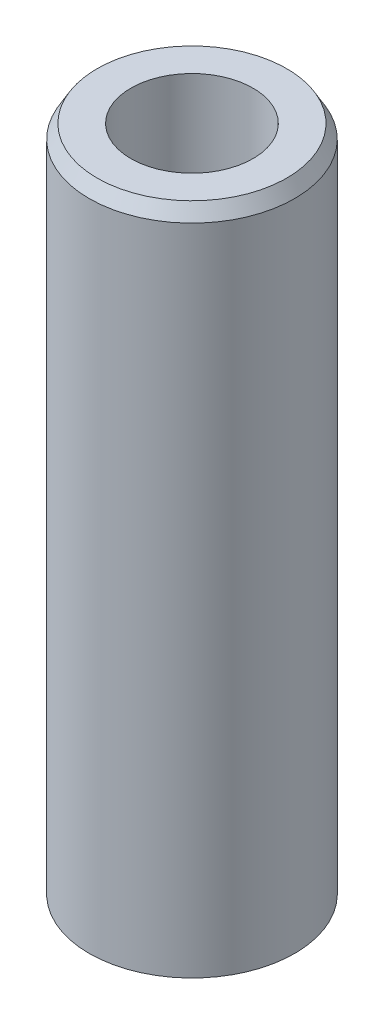
ISO-10303-21;
HEADER;
FILE_DESCRIPTION(('STEP AP214'),'2;1');
FILE_NAME('part.step','',(''),(''),'','','');
FILE_SCHEMA(('AUTOMOTIVE_DESIGN { 1 0 10303 214 1 1 1 1 }'));
ENDSEC;
DATA;
#1=APPLICATION_CONTEXT('core data for automotive mechanical design processes');
#2=APPLICATION_PROTOCOL_DEFINITION('international standard','automotive_design',2000,#1);
#3=PRODUCT_CONTEXT('',#1,'mechanical');
#4=PRODUCT('Part','Part','',(#3));
#5=PRODUCT_RELATED_PRODUCT_CATEGORY('part','',(#4));
#6=PRODUCT_DEFINITION_FORMATION('','',#4);
#7=PRODUCT_DEFINITION_CONTEXT('part definition',#1,'design');
#8=PRODUCT_DEFINITION('design','',#6,#7);
#9=PRODUCT_DEFINITION_SHAPE('','',#8);
#10=(LENGTH_UNIT() NAMED_UNIT(*) SI_UNIT(.MILLI.,.METRE.));
#11=(NAMED_UNIT(*) PLANE_ANGLE_UNIT() SI_UNIT($,.RADIAN.));
#12=(NAMED_UNIT(*) SI_UNIT($,.STERADIAN.) SOLID_ANGLE_UNIT());
#13=UNCERTAINTY_MEASURE_WITH_UNIT(LENGTH_MEASURE(1.E-05),#10,'distance_accuracy_value','');
#14=(GEOMETRIC_REPRESENTATION_CONTEXT(3) GLOBAL_UNCERTAINTY_ASSIGNED_CONTEXT((#13)) GLOBAL_UNIT_ASSIGNED_CONTEXT((#10,
#11,#12)) REPRESENTATION_CONTEXT('',''));
#15=CARTESIAN_POINT('',(0.,0.,0.));
#16=DIRECTION('',(0.,0.,1.));
#17=DIRECTION('',(1.,0.,0.));
#18=AXIS2_PLACEMENT_3D('',#15,#16,#17);
#19=CARTESIAN_POINT('',(0.,115.021167094316,0.));
#20=DIRECTION('',(0.,-1.,0.));
#21=DIRECTION('',(0.,0.,-1.));
#22=AXIS2_PLACEMENT_3D('',#19,#20,#21);
#23=CYLINDRICAL_SURFACE('',#22,17.5);
#24=CARTESIAN_POINT('',(0.,112.679900352407,0.));
#25=DIRECTION('',(0.,1.,0.));
#26=DIRECTION('',(0.,0.,1.));
#27=AXIS2_PLACEMENT_3D('',#24,#25,#26);
#28=CIRCLE('',#27,17.5);
#29=CARTESIAN_POINT('',(0.,112.679900352407,17.5));
#30=VERTEX_POINT('',#29);
#31=EDGE_CURVE('E50',#30,#30,#28,.F.);
#32=ORIENTED_EDGE('',*,*,#31,.T.);
#33=EDGE_LOOP('',(#32));
#34=FACE_BOUND('',#33,.T.);
#35=CARTESIAN_POINT('',(0.,1.35173098368588,0.));
#36=DIRECTION('',(0.,1.,0.));
#37=DIRECTION('',(0.,0.,1.));
#38=AXIS2_PLACEMENT_3D('',#35,#36,#37);
#39=CIRCLE('',#38,17.5);
#40=CARTESIAN_POINT('',(0.,1.35173098368588,17.5));
#41=VERTEX_POINT('',#40);
#42=EDGE_CURVE('E51',#41,#41,#39,.T.);
#43=ORIENTED_EDGE('',*,*,#42,.T.);
#44=EDGE_LOOP('',(#43));
#45=FACE_BOUND('',#44,.T.);
#46=ADVANCED_FACE('F39',(#34,#45),#23,.T.);
#47=CARTESIAN_POINT('',(0.,115.021167094316,0.));
#48=DIRECTION('',(0.,1.,0.));
#49=DIRECTION('',(0.,0.,1.));
#50=AXIS2_PLACEMENT_3D('',#47,#48,#49);
#51=PLANE('',#50);
#52=CARTESIAN_POINT('',(0.,115.021167094316,0.));
#53=DIRECTION('',(0.,1.,0.));
#54=DIRECTION('',(0.,0.,1.));
#55=AXIS2_PLACEMENT_3D('',#52,#53,#54);
#56=CIRCLE('',#55,16.1482690163141);
#57=CARTESIAN_POINT('',(0.,115.021167094316,16.1482690163141));
#58=VERTEX_POINT('',#57);
#59=EDGE_CURVE('E54',#58,#58,#56,.T.);
#60=ORIENTED_EDGE('',*,*,#59,.T.);
#61=EDGE_LOOP('',(#60));
#62=FACE_BOUND('',#61,.T.);
#63=CARTESIAN_POINT('',(0.,115.021167094316,0.));
#64=DIRECTION('',(0.,1.,0.));
#65=DIRECTION('',(0.,0.,1.));
#66=AXIS2_PLACEMENT_3D('',#63,#64,#65);
#67=CIRCLE('',#66,10.4032611377122);
#68=CARTESIAN_POINT('',(0.,115.021167094316,10.4032611377122));
#69=VERTEX_POINT('',#68);
#70=EDGE_CURVE('E58',#69,#69,#67,.T.);
#71=ORIENTED_EDGE('',*,*,#70,.F.);
#72=EDGE_LOOP('',(#71));
#73=FACE_BOUND('',#72,.T.);
#74=ADVANCED_FACE('F69',(#62,#73),#51,.T.);
#75=CARTESIAN_POINT('',(0.,0.,0.));
#76=DIRECTION('',(0.,1.,0.));
#77=DIRECTION('',(0.,0.,1.));
#78=AXIS2_PLACEMENT_3D('',#75,#76,#77);
#79=PLANE('',#78);
#80=CARTESIAN_POINT('',(0.,0.,0.));
#81=DIRECTION('',(0.,1.,0.));
#82=DIRECTION('',(0.,0.,1.));
#83=AXIS2_PLACEMENT_3D('',#80,#81,#82);
#84=CIRCLE('',#83,15.158733258091);
#85=CARTESIAN_POINT('',(0.,0.,15.158733258091));
#86=VERTEX_POINT('',#85);
#87=EDGE_CURVE('E10',#86,#86,#84,.F.);
#88=ORIENTED_EDGE('',*,*,#87,.T.);
#89=EDGE_LOOP('',(#88));
#90=FACE_BOUND('',#89,.T.);
#91=CARTESIAN_POINT('',(0.,0.,0.));
#92=DIRECTION('',(0.,1.,0.));
#93=DIRECTION('',(0.,0.,1.));
#94=AXIS2_PLACEMENT_3D('',#91,#92,#93);
#95=CIRCLE('',#94,10.4032611377122);
#96=CARTESIAN_POINT('',(0.,0.,10.4032611377122));
#97=VERTEX_POINT('',#96);
#98=EDGE_CURVE('E63',#97,#97,#95,.T.);
#99=ORIENTED_EDGE('',*,*,#98,.T.);
#100=EDGE_LOOP('',(#99));
#101=FACE_BOUND('',#100,.T.);
#102=ADVANCED_FACE('F75',(#90,#101),#79,.F.);
#103=CARTESIAN_POINT('',(0.,115.021167094316,0.));
#104=DIRECTION('',(0.,-1.,0.));
#105=DIRECTION('',(0.,0.,-1.));
#106=AXIS2_PLACEMENT_3D('',#103,#104,#105);
#107=CYLINDRICAL_SURFACE('',#106,10.4032611377122);
#108=ORIENTED_EDGE('',*,*,#70,.T.);
#109=EDGE_LOOP('',(#108));
#110=FACE_BOUND('',#109,.T.);
#111=ORIENTED_EDGE('',*,*,#98,.F.);
#112=EDGE_LOOP('',(#111));
#113=FACE_BOUND('',#112,.T.);
#114=ADVANCED_FACE('F70',(#110,#113),#107,.F.);
#115=CARTESIAN_POINT('',(0.,115.021167094316,0.));
#116=DIRECTION('',(0.,-1.,0.));
#117=DIRECTION('',(0.,0.,-1.));
#118=AXIS2_PLACEMENT_3D('',#115,#116,#117);
#119=CONICAL_SURFACE('',#118,16.1482690163141,0.523598775598295);
#120=ORIENTED_EDGE('',*,*,#31,.F.);
#121=EDGE_LOOP('',(#120));
#122=FACE_BOUND('',#121,.T.);
#123=ORIENTED_EDGE('',*,*,#59,.F.);
#124=EDGE_LOOP('',(#123));
#125=FACE_BOUND('',#124,.T.);
#126=ADVANCED_FACE('F81',(#122,#125),#119,.T.);
#127=CARTESIAN_POINT('',(0.,1.35173098368588,0.));
#128=DIRECTION('',(0.,1.,0.));
#129=DIRECTION('',(0.,0.,1.));
#130=AXIS2_PLACEMENT_3D('',#127,#128,#129);
#131=CONICAL_SURFACE('',#130,17.5,1.0471975511966);
#132=CARTESIAN_POINT('',(0.,0.,15.158733258091));
#133=CARTESIAN_POINT('',(0.,0.014080531080061,15.1831214533192));
#134=CARTESIAN_POINT('',(0.,0.0281610621601222,15.2075096485475));
#135=CARTESIAN_POINT('',(0.,0.0563221243202447,15.2562860390039));
#136=CARTESIAN_POINT('',(0.,0.0704026554003059,15.2806742342321));
#137=CARTESIAN_POINT('',(0.,0.0985637175604284,15.3294506246885));
#138=CARTESIAN_POINT('',(0.,0.11264424864049,15.3538388199168));
#139=CARTESIAN_POINT('',(0.,0.140805310800612,15.4026152103732));
#140=CARTESIAN_POINT('',(0.,0.154885841880673,15.4270034056014));
#141=CARTESIAN_POINT('',(0.,0.183046904040796,15.4757797960579));
#142=CARTESIAN_POINT('',(0.,0.197127435120857,15.5001679912861));
#143=CARTESIAN_POINT('',(0.,0.22528849728098,15.5489443817425));
#144=CARTESIAN_POINT('',(0.,0.239369028361041,15.5733325769707));
#145=CARTESIAN_POINT('',(0.,0.267530090521163,15.6221089674272));
#146=CARTESIAN_POINT('',(0.,0.281610621601224,15.6464971626554));
#147=CARTESIAN_POINT('',(0.,0.309771683761347,15.6952735531118));
#148=CARTESIAN_POINT('',(0.,0.323852214841408,15.71966174834));
#149=CARTESIAN_POINT('',(0.,0.352013277001531,15.7684381387965));
#150=CARTESIAN_POINT('',(0.,0.366093808081592,15.7928263340247));
#151=CARTESIAN_POINT('',(0.,0.394254870241714,15.8416027244811));
#152=CARTESIAN_POINT('',(0.,0.408335401321776,15.8659909197094));
#153=CARTESIAN_POINT('',(0.,0.436496463481898,15.9147673101658));
#154=CARTESIAN_POINT('',(0.,0.450576994561959,15.939155505394));
#155=CARTESIAN_POINT('',(0.,0.478738056722081,15.9879318958504));
#156=CARTESIAN_POINT('',(0.,0.492818587802143,16.0123200910787));
#157=CARTESIAN_POINT('',(0.,0.520979649962266,16.0610964815351));
#158=CARTESIAN_POINT('',(0.,0.535060181042326,16.0854846767633));
#159=CARTESIAN_POINT('',(0.,0.563221243202449,16.1342610672198));
#160=CARTESIAN_POINT('',(0.,0.577301774282511,16.158649262448));
#161=CARTESIAN_POINT('',(0.,0.605462836442633,16.2074256529044));
#162=CARTESIAN_POINT('',(0.,0.619543367522694,16.2318138481326));
#163=CARTESIAN_POINT('',(0.,0.647704429682816,16.2805902385891));
#164=CARTESIAN_POINT('',(0.,0.661784960762878,16.3049784338173));
#165=CARTESIAN_POINT('',(0.,0.689946022923001,16.3537548242737));
#166=CARTESIAN_POINT('',(0.,0.704026554003061,16.3781430195019));
#167=CARTESIAN_POINT('',(0.,0.732187616163184,16.4269194099584));
#168=CARTESIAN_POINT('',(0.,0.746268147243245,16.4513076051866));
#169=CARTESIAN_POINT('',(0.,0.774429209403368,16.500083995643));
#170=CARTESIAN_POINT('',(0.,0.788509740483429,16.5244721908713));
#171=CARTESIAN_POINT('',(0.,0.816670802643551,16.5732485813277));
#172=CARTESIAN_POINT('',(0.,0.830751333723612,16.5976367765559));
#173=CARTESIAN_POINT('',(0.,0.858912395883735,16.6464131670124));
#174=CARTESIAN_POINT('',(0.,0.872992926963797,16.6708013622406));
#175=CARTESIAN_POINT('',(0.,0.901153989123919,16.719577752697));
#176=CARTESIAN_POINT('',(0.,0.91523452020398,16.7439659479252));
#177=CARTESIAN_POINT('',(0.,0.943395582364102,16.7927423383817));
#178=CARTESIAN_POINT('',(0.,0.957476113444164,16.8171305336099));
#179=CARTESIAN_POINT('',(0.,0.985637175604286,16.8659069240663));
#180=CARTESIAN_POINT('',(0.,0.999717706684347,16.8902951192945));
#181=CARTESIAN_POINT('',(0.,1.02787876884447,16.939071509751));
#182=CARTESIAN_POINT('',(0.,1.04195929992453,16.9634597049792));
#183=CARTESIAN_POINT('',(0.,1.07012036208465,17.0122360954356));
#184=CARTESIAN_POINT('',(0.,1.08420089316471,17.0366242906639));
#185=CARTESIAN_POINT('',(0.,1.11236195532484,17.0854006811203));
#186=CARTESIAN_POINT('',(0.,1.1264424864049,17.1097888763485));
#187=CARTESIAN_POINT('',(0.,1.15460354856502,17.1585652668049));
#188=CARTESIAN_POINT('',(0.,1.16868407964508,17.1829534620332));
#189=CARTESIAN_POINT('',(0.,1.1968451418052,17.2317298524896));
#190=CARTESIAN_POINT('',(0.,1.21092567288527,17.2561180477178));
#191=CARTESIAN_POINT('',(0.,1.23908673504539,17.3048944381743));
#192=CARTESIAN_POINT('',(0.,1.25316726612545,17.3292826334025));
#193=CARTESIAN_POINT('',(0.,1.28132832828557,17.3780590238589));
#194=CARTESIAN_POINT('',(0.,1.29540885936563,17.4024472190871));
#195=CARTESIAN_POINT('',(0.,1.32356992152576,17.4512236095436));
#196=CARTESIAN_POINT('',(0.,1.33765045260582,17.4756118047718));
#197=CARTESIAN_POINT('',(0.,1.35173098368588,17.5));
#198=B_SPLINE_CURVE_WITH_KNOTS('',3,(#132,#133,#134,#135,#136,#137,#138,#139,#140,#141,#142,
#143,#144,#145,#146,#147,#148,#149,#150,#151,#152,#153,#154,#155,#156,#157,#158,#159,#160,#161,
#162,#163,#164,#165,#166,#167,#168,#169,#170,#171,#172,#173,#174,#175,#176,#177,#178,#179,#180,
#181,#182,#183,#184,#185,#186,#187,#188,#189,#190,#191,#192,#193,#194,#195,#196,#197),
.UNSPECIFIED.,.F.,.F.,(4,2,2,2,2,2,2,2,2,2,2,2,2,2,2,2,2,2,2,2,2,2,2,2,2,2,2,2,2,2,2,2,4),(0.,
0.0844831864803671,0.168966372960734,0.253449559441101,0.337932745921468,0.422415932401835,
0.506899118882203,0.591382305362571,0.675865491842937,0.760348678323305,0.844831864803671,
0.929315051284039,1.01379823776441,1.09828142424477,1.18276461072514,1.26724779720551,
1.35173098368587,1.43621417016624,1.52069735664661,1.60518054312698,1.68966372960735,
1.77414691608771,1.85863010256808,1.94311328904845,2.02759647552881,2.11207966200918,
2.19656284848955,2.28104603496991,2.36552922145028,2.45001240793065,2.53449559441102,
2.61897878089138,2.70346196737175),.UNSPECIFIED.);
#199=EDGE_CURVE('BSEAM45',#86,#41,#198,.T.);
#200=ORIENTED_EDGE('',*,*,#87,.F.);
#201=ORIENTED_EDGE('',*,*,#42,.F.);
#202=ORIENTED_EDGE('',*,*,#199,.T.);
#203=ORIENTED_EDGE('',*,*,#199,.F.);
#204=EDGE_LOOP('',(#200,#202,#201,#203));
#205=FACE_BOUND('',#204,.T.);
#206=ADVANCED_FACE('F45',(#205),#131,.T.);
#207=CLOSED_SHELL('',(#46,#74,#102,#114,#126,#206));
#208=MANIFOLD_SOLID_BREP('B2',#207);
#209=ADVANCED_BREP_SHAPE_REPRESENTATION('',(#18,#208),#14);
#210=SHAPE_DEFINITION_REPRESENTATION(#9,#209);
ENDSEC;
END-ISO-10303-21;
